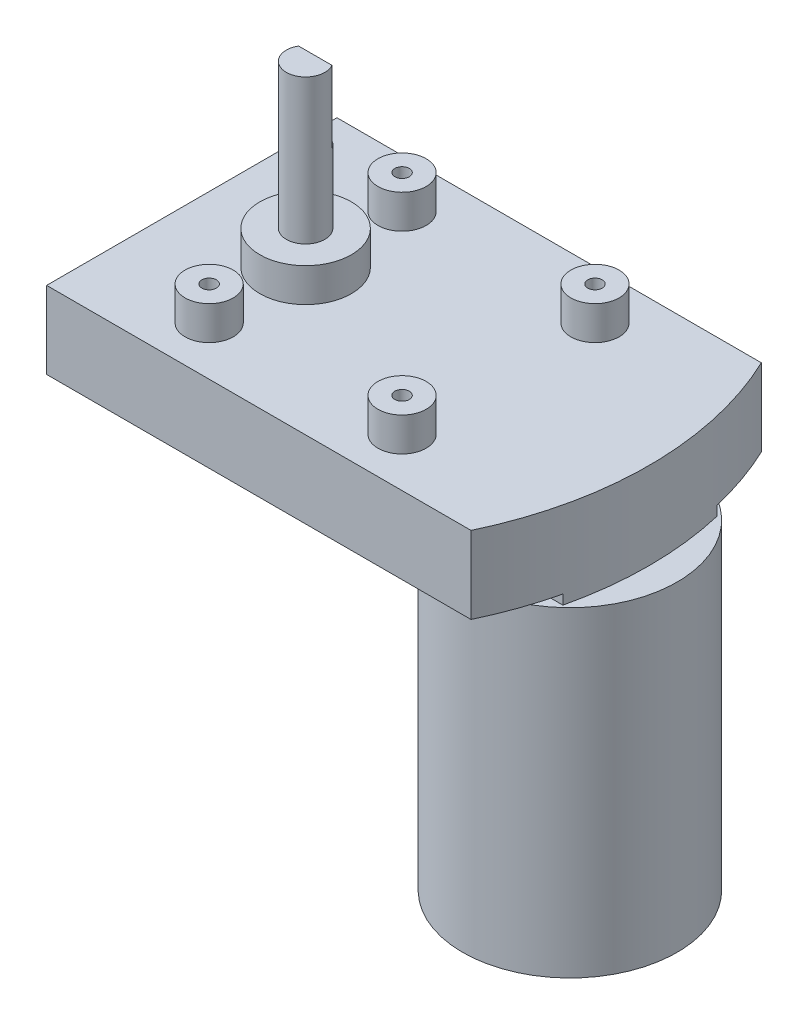
ISO-10303-21;
HEADER;
FILE_DESCRIPTION(('STEP AP214'),'2;1');
FILE_NAME('part.step','',(''),(''),'','','');
FILE_SCHEMA(('AUTOMOTIVE_DESIGN { 1 0 10303 214 1 1 1 1 }'));
ENDSEC;
DATA;
#1=APPLICATION_CONTEXT('core data for automotive mechanical design processes');
#2=APPLICATION_PROTOCOL_DEFINITION('international standard','automotive_design',2000,#1);
#3=PRODUCT_CONTEXT('',#1,'mechanical');
#4=PRODUCT('Part','Part','',(#3));
#5=PRODUCT_RELATED_PRODUCT_CATEGORY('part','',(#4));
#6=PRODUCT_DEFINITION_FORMATION('','',#4);
#7=PRODUCT_DEFINITION_CONTEXT('part definition',#1,'design');
#8=PRODUCT_DEFINITION('design','',#6,#7);
#9=PRODUCT_DEFINITION_SHAPE('','',#8);
#10=(LENGTH_UNIT() NAMED_UNIT(*) SI_UNIT(.MILLI.,.METRE.));
#11=(NAMED_UNIT(*) PLANE_ANGLE_UNIT() SI_UNIT($,.RADIAN.));
#12=(NAMED_UNIT(*) SI_UNIT($,.STERADIAN.) SOLID_ANGLE_UNIT());
#13=UNCERTAINTY_MEASURE_WITH_UNIT(LENGTH_MEASURE(1.E-05),#10,'distance_accuracy_value','');
#14=(GEOMETRIC_REPRESENTATION_CONTEXT(3) GLOBAL_UNCERTAINTY_ASSIGNED_CONTEXT((#13)) GLOBAL_UNIT_ASSIGNED_CONTEXT((#10,
#11,#12)) REPRESENTATION_CONTEXT('',''));
#15=CARTESIAN_POINT('',(0.,0.,0.));
#16=DIRECTION('',(0.,0.,1.));
#17=DIRECTION('',(1.,0.,0.));
#18=AXIS2_PLACEMENT_3D('',#15,#16,#17);
#19=CARTESIAN_POINT('',(-19.1980221209493,-2.,0.));
#20=DIRECTION('',(0.,-1.,0.));
#21=DIRECTION('',(0.,0.,-1.));
#22=AXIS2_PLACEMENT_3D('',#19,#20,#21);
#23=PLANE('',#22);
#24=CARTESIAN_POINT('',(34.4009889395253,-2.,0.));
#25=DIRECTION('',(0.,-1.,0.));
#26=DIRECTION('',(0.,0.,-1.));
#27=AXIS2_PLACEMENT_3D('',#24,#25,#26);
#28=CIRCLE('',#27,22.25);
#29=CARTESIAN_POINT('',(18.9393428434591,-2.,16.));
#30=VERTEX_POINT('',#29);
#31=CARTESIAN_POINT('',(18.,-2.,15.035626418795));
#32=VERTEX_POINT('',#31);
#33=EDGE_CURVE('E55',#30,#32,#28,.T.);
#34=ORIENTED_EDGE('',*,*,#33,.F.);
#35=DIRECTION('',(-1.,0.,0.));
#36=VECTOR('',#35,1.);
#37=CARTESIAN_POINT('',(18.,-2.,16.));
#38=LINE('',#37,#36);
#39=CARTESIAN_POINT('',(18.,-2.,16.));
#40=VERTEX_POINT('',#39);
#41=EDGE_CURVE('E171',#30,#40,#38,.T.);
#42=ORIENTED_EDGE('',*,*,#41,.T.);
#43=DIRECTION('',(0.,0.,-1.));
#44=VECTOR('',#43,1.);
#45=CARTESIAN_POINT('',(18.,-2.,-16.));
#46=LINE('',#45,#44);
#47=EDGE_CURVE('E152',#40,#32,#46,.T.);
#48=ORIENTED_EDGE('',*,*,#47,.T.);
#49=EDGE_LOOP('',(#34,#42,#48));
#50=FACE_BOUND('',#49,.T.);
#51=ADVANCED_FACE('F44',(#50),#23,.T.);
#52=CARTESIAN_POINT('',(0.,0.,0.));
#53=DIRECTION('',(0.,1.,0.));
#54=DIRECTION('',(0.,0.,1.));
#55=AXIS2_PLACEMENT_3D('',#52,#53,#54);
#56=PLANE('',#55);
#57=DIRECTION('',(-1.,0.,0.));
#58=VECTOR('',#57,1.);
#59=CARTESIAN_POINT('',(18.,0.,16.));
#60=LINE('',#59,#58);
#61=CARTESIAN_POINT('',(48.948878028654,0.,16.));
#62=VERTEX_POINT('',#61);
#63=CARTESIAN_POINT('',(18.,0.,16.));
#64=VERTEX_POINT('',#63);
#65=EDGE_CURVE('E179',#62,#64,#60,.T.);
#66=ORIENTED_EDGE('',*,*,#65,.F.);
#67=CARTESIAN_POINT('',(-19.1980221209493,0.,0.));
#68=DIRECTION('',(0.,1.,0.));
#69=DIRECTION('',(0.,0.,1.));
#70=AXIS2_PLACEMENT_3D('',#67,#68,#69);
#71=CIRCLE('',#70,70.);
#72=CARTESIAN_POINT('',(44.,0.,30.1));
#73=VERTEX_POINT('',#72);
#74=EDGE_CURVE('E191',#73,#62,#71,.T.);
#75=ORIENTED_EDGE('',*,*,#74,.F.);
#76=DIRECTION('',(1.,0.,0.));
#77=VECTOR('',#76,1.);
#78=CARTESIAN_POINT('',(-44.,0.,30.1));
#79=LINE('',#78,#77);
#80=CARTESIAN_POINT('',(-44.,0.,30.1));
#81=VERTEX_POINT('',#80);
#82=EDGE_CURVE('E268',#81,#73,#79,.T.);
#83=ORIENTED_EDGE('',*,*,#82,.F.);
#84=DIRECTION('',(0.,0.,-1.));
#85=VECTOR('',#84,1.);
#86=CARTESIAN_POINT('',(-44.,0.,30.1));
#87=LINE('',#86,#85);
#88=CARTESIAN_POINT('',(-44.,0.,-30.1));
#89=VERTEX_POINT('',#88);
#90=EDGE_CURVE('E272',#81,#89,#87,.T.);
#91=ORIENTED_EDGE('',*,*,#90,.T.);
#92=DIRECTION('',(1.,0.,0.));
#93=VECTOR('',#92,1.);
#94=CARTESIAN_POINT('',(-44.,0.,-30.1));
#95=LINE('',#94,#93);
#96=CARTESIAN_POINT('',(44.,0.,-30.1));
#97=VERTEX_POINT('',#96);
#98=EDGE_CURVE('E279',#89,#97,#95,.T.);
#99=ORIENTED_EDGE('',*,*,#98,.T.);
#100=CARTESIAN_POINT('',(48.948878028654,0.,-16.));
#101=VERTEX_POINT('',#100);
#102=EDGE_CURVE('E190',#101,#97,#71,.T.);
#103=ORIENTED_EDGE('',*,*,#102,.F.);
#104=DIRECTION('',(1.,0.,0.));
#105=VECTOR('',#104,1.);
#106=CARTESIAN_POINT('',(18.,0.,-16.));
#107=LINE('',#106,#105);
#108=CARTESIAN_POINT('',(18.,0.,-16.));
#109=VERTEX_POINT('',#108);
#110=EDGE_CURVE('E177',#109,#101,#107,.T.);
#111=ORIENTED_EDGE('',*,*,#110,.F.);
#112=DIRECTION('',(0.,0.,-1.));
#113=VECTOR('',#112,1.);
#114=CARTESIAN_POINT('',(18.,0.,-16.));
#115=LINE('',#114,#113);
#116=EDGE_CURVE('E174',#64,#109,#115,.T.);
#117=ORIENTED_EDGE('',*,*,#116,.F.);
#118=EDGE_LOOP('',(#66,#75,#83,#91,#99,#103,#111,#117));
#119=FACE_BOUND('',#118,.T.);
#120=ADVANCED_FACE('F301',(#119),#56,.F.);
#121=CARTESIAN_POINT('',(-44.,16.,30.1));
#122=DIRECTION('',(0.,0.,-1.));
#123=DIRECTION('',(-1.,0.,0.));
#124=AXIS2_PLACEMENT_3D('',#121,#122,#123);
#125=PLANE('',#124);
#126=ORIENTED_EDGE('',*,*,#82,.T.);
#127=DIRECTION('',(0.,-1.,0.));
#128=VECTOR('',#127,1.);
#129=CARTESIAN_POINT('',(44.,16.,30.1));
#130=LINE('',#129,#128);
#131=CARTESIAN_POINT('',(44.,16.,30.1));
#132=VERTEX_POINT('',#131);
#133=EDGE_CURVE('E48',#132,#73,#130,.T.);
#134=ORIENTED_EDGE('',*,*,#133,.F.);
#135=DIRECTION('',(1.,0.,0.));
#136=VECTOR('',#135,1.);
#137=CARTESIAN_POINT('',(-44.,16.,30.1));
#138=LINE('',#137,#136);
#139=CARTESIAN_POINT('',(-44.,16.,30.1));
#140=VERTEX_POINT('',#139);
#141=EDGE_CURVE('E269',#140,#132,#138,.T.);
#142=ORIENTED_EDGE('',*,*,#141,.F.);
#143=DIRECTION('',(0.,-1.,0.));
#144=VECTOR('',#143,1.);
#145=CARTESIAN_POINT('',(-44.,16.,30.1));
#146=LINE('',#145,#144);
#147=EDGE_CURVE('E277',#140,#81,#146,.T.);
#148=ORIENTED_EDGE('',*,*,#147,.T.);
#149=EDGE_LOOP('',(#126,#134,#142,#148));
#150=FACE_BOUND('',#149,.T.);
#151=ADVANCED_FACE('F46',(#150),#125,.F.);
#152=CARTESIAN_POINT('',(-44.,16.,-30.1));
#153=DIRECTION('',(0.,0.,-1.));
#154=DIRECTION('',(-1.,0.,0.));
#155=AXIS2_PLACEMENT_3D('',#152,#153,#154);
#156=PLANE('',#155);
#157=ORIENTED_EDGE('',*,*,#98,.F.);
#158=DIRECTION('',(0.,-1.,0.));
#159=VECTOR('',#158,1.);
#160=CARTESIAN_POINT('',(-44.,16.,-30.1));
#161=LINE('',#160,#159);
#162=CARTESIAN_POINT('',(-44.,16.,-30.1));
#163=VERTEX_POINT('',#162);
#164=EDGE_CURVE('E285',#163,#89,#161,.T.);
#165=ORIENTED_EDGE('',*,*,#164,.F.);
#166=DIRECTION('',(1.,0.,0.));
#167=VECTOR('',#166,1.);
#168=CARTESIAN_POINT('',(-44.,16.,-30.1));
#169=LINE('',#168,#167);
#170=CARTESIAN_POINT('',(44.,16.,-30.1));
#171=VERTEX_POINT('',#170);
#172=EDGE_CURVE('E271',#163,#171,#169,.T.);
#173=ORIENTED_EDGE('',*,*,#172,.T.);
#174=DIRECTION('',(0.,-1.,0.));
#175=VECTOR('',#174,1.);
#176=CARTESIAN_POINT('',(44.,16.,-30.1));
#177=LINE('',#176,#175);
#178=EDGE_CURVE('E286',#171,#97,#177,.T.);
#179=ORIENTED_EDGE('',*,*,#178,.T.);
#180=EDGE_LOOP('',(#157,#165,#173,#179));
#181=FACE_BOUND('',#180,.T.);
#182=ADVANCED_FACE('F309',(#181),#156,.T.);
#183=CARTESIAN_POINT('',(-44.,16.,30.1));
#184=DIRECTION('',(-1.,0.,0.));
#185=DIRECTION('',(0.,0.,1.));
#186=AXIS2_PLACEMENT_3D('',#183,#184,#185);
#187=PLANE('',#186);
#188=ORIENTED_EDGE('',*,*,#90,.F.);
#189=ORIENTED_EDGE('',*,*,#147,.F.);
#190=DIRECTION('',(0.,0.,-1.));
#191=VECTOR('',#190,1.);
#192=CARTESIAN_POINT('',(-44.,16.,30.1));
#193=LINE('',#192,#191);
#194=EDGE_CURVE('E274',#140,#163,#193,.T.);
#195=ORIENTED_EDGE('',*,*,#194,.T.);
#196=ORIENTED_EDGE('',*,*,#164,.T.);
#197=EDGE_LOOP('',(#188,#189,#195,#196));
#198=FACE_BOUND('',#197,.T.);
#199=ADVANCED_FACE('F315',(#198),#187,.T.);
#200=CARTESIAN_POINT('',(0.,16.,0.));
#201=DIRECTION('',(0.,1.,0.));
#202=DIRECTION('',(0.,0.,1.));
#203=AXIS2_PLACEMENT_3D('',#200,#201,#202);
#204=PLANE('',#203);
#205=CARTESIAN_POINT('',(19.6,16.,20.));
#206=DIRECTION('',(0.,1.,0.));
#207=DIRECTION('',(0.,0.,1.));
#208=AXIS2_PLACEMENT_3D('',#205,#206,#207);
#209=CIRCLE('',#208,5.);
#210=CARTESIAN_POINT('',(19.6,16.,25.));
#211=VERTEX_POINT('',#210);
#212=EDGE_CURVE('E241',#211,#211,#209,.F.);
#213=ORIENTED_EDGE('',*,*,#212,.T.);
#214=EDGE_LOOP('',(#213));
#215=FACE_BOUND('',#214,.T.);
#216=CARTESIAN_POINT('',(19.6,16.,-20.));
#217=DIRECTION('',(0.,1.,0.));
#218=DIRECTION('',(0.,0.,1.));
#219=AXIS2_PLACEMENT_3D('',#216,#217,#218);
#220=CIRCLE('',#219,5.);
#221=CARTESIAN_POINT('',(19.6,16.,-15.));
#222=VERTEX_POINT('',#221);
#223=EDGE_CURVE('E247',#222,#222,#220,.F.);
#224=ORIENTED_EDGE('',*,*,#223,.T.);
#225=EDGE_LOOP('',(#224));
#226=FACE_BOUND('',#225,.T.);
#227=CARTESIAN_POINT('',(-20.4,16.,-20.));
#228=DIRECTION('',(0.,1.,0.));
#229=DIRECTION('',(0.,0.,1.));
#230=AXIS2_PLACEMENT_3D('',#227,#228,#229);
#231=CIRCLE('',#230,5.);
#232=CARTESIAN_POINT('',(-20.4,16.,-15.));
#233=VERTEX_POINT('',#232);
#234=EDGE_CURVE('E253',#233,#233,#231,.F.);
#235=ORIENTED_EDGE('',*,*,#234,.T.);
#236=EDGE_LOOP('',(#235));
#237=FACE_BOUND('',#236,.T.);
#238=CARTESIAN_POINT('',(-20.4,16.,0.));
#239=DIRECTION('',(0.,1.,0.));
#240=DIRECTION('',(0.,0.,1.));
#241=AXIS2_PLACEMENT_3D('',#238,#239,#240);
#242=CIRCLE('',#241,9.5);
#243=CARTESIAN_POINT('',(-20.4,16.,9.50000000000001));
#244=VERTEX_POINT('',#243);
#245=EDGE_CURVE('E259',#244,#244,#242,.F.);
#246=ORIENTED_EDGE('',*,*,#245,.T.);
#247=EDGE_LOOP('',(#246));
#248=FACE_BOUND('',#247,.T.);
#249=CARTESIAN_POINT('',(-20.4,16.,20.));
#250=DIRECTION('',(0.,1.,0.));
#251=DIRECTION('',(0.,0.,1.));
#252=AXIS2_PLACEMENT_3D('',#249,#250,#251);
#253=CIRCLE('',#252,5.);
#254=CARTESIAN_POINT('',(-20.4,16.,25.));
#255=VERTEX_POINT('',#254);
#256=EDGE_CURVE('E265',#255,#255,#253,.F.);
#257=ORIENTED_EDGE('',*,*,#256,.T.);
#258=EDGE_LOOP('',(#257));
#259=FACE_BOUND('',#258,.T.);
#260=ORIENTED_EDGE('',*,*,#141,.T.);
#261=CARTESIAN_POINT('',(-19.1980221209493,16.,0.));
#262=DIRECTION('',(0.,1.,0.));
#263=DIRECTION('',(0.,0.,1.));
#264=AXIS2_PLACEMENT_3D('',#261,#262,#263);
#265=CIRCLE('',#264,70.);
#266=EDGE_CURVE('E194',#132,#171,#265,.T.);
#267=ORIENTED_EDGE('',*,*,#266,.T.);
#268=ORIENTED_EDGE('',*,*,#172,.F.);
#269=ORIENTED_EDGE('',*,*,#194,.F.);
#270=EDGE_LOOP('',(#260,#267,#268,#269));
#271=FACE_BOUND('',#270,.T.);
#272=ADVANCED_FACE('F314',(#215,#226,#237,#248,#259,#271),#204,.T.);
#273=CARTESIAN_POINT('',(-20.4,23.,20.));
#274=DIRECTION('',(0.,-1.,0.));
#275=DIRECTION('',(0.,0.,-1.));
#276=AXIS2_PLACEMENT_3D('',#273,#274,#275);
#277=CYLINDRICAL_SURFACE('',#276,5.);
#278=ORIENTED_EDGE('',*,*,#256,.F.);
#279=EDGE_LOOP('',(#278));
#280=FACE_BOUND('',#279,.T.);
#281=CARTESIAN_POINT('',(-20.4,23.,20.));
#282=DIRECTION('',(0.,1.,0.));
#283=DIRECTION('',(0.,0.,1.));
#284=AXIS2_PLACEMENT_3D('',#281,#282,#283);
#285=CIRCLE('',#284,5.);
#286=CARTESIAN_POINT('',(-20.4,23.,25.));
#287=VERTEX_POINT('',#286);
#288=EDGE_CURVE('E262',#287,#287,#285,.T.);
#289=ORIENTED_EDGE('',*,*,#288,.F.);
#290=EDGE_LOOP('',(#289));
#291=FACE_BOUND('',#290,.T.);
#292=ADVANCED_FACE('F427',(#280,#291),#277,.T.);
#293=CARTESIAN_POINT('',(-20.4,23.,20.));
#294=DIRECTION('',(0.,1.,0.));
#295=DIRECTION('',(0.,0.,1.));
#296=AXIS2_PLACEMENT_3D('',#293,#294,#295);
#297=PLANE('',#296);
#298=CARTESIAN_POINT('',(-20.4,23.,20.));
#299=DIRECTION('',(0.,1.,0.));
#300=DIRECTION('',(0.,0.,1.));
#301=AXIS2_PLACEMENT_3D('',#298,#299,#300);
#302=CIRCLE('',#301,1.5);
#303=CARTESIAN_POINT('',(-20.4,23.,21.5));
#304=VERTEX_POINT('',#303);
#305=EDGE_CURVE('E197',#304,#304,#302,.T.);
#306=ORIENTED_EDGE('',*,*,#305,.F.);
#307=EDGE_LOOP('',(#306));
#308=FACE_BOUND('',#307,.T.);
#309=ORIENTED_EDGE('',*,*,#288,.T.);
#310=EDGE_LOOP('',(#309));
#311=FACE_BOUND('',#310,.T.);
#312=ADVANCED_FACE('F420',(#308,#311),#297,.T.);
#313=CARTESIAN_POINT('',(-20.4,23.,0.));
#314=DIRECTION('',(0.,-1.,0.));
#315=DIRECTION('',(0.,0.,-1.));
#316=AXIS2_PLACEMENT_3D('',#313,#314,#315);
#317=CYLINDRICAL_SURFACE('',#316,9.5);
#318=ORIENTED_EDGE('',*,*,#245,.F.);
#319=EDGE_LOOP('',(#318));
#320=FACE_BOUND('',#319,.T.);
#321=CARTESIAN_POINT('',(-20.4,23.,0.));
#322=DIRECTION('',(0.,1.,0.));
#323=DIRECTION('',(0.,0.,1.));
#324=AXIS2_PLACEMENT_3D('',#321,#322,#323);
#325=CIRCLE('',#324,9.5);
#326=CARTESIAN_POINT('',(-20.4,23.,9.50000000000001));
#327=VERTEX_POINT('',#326);
#328=EDGE_CURVE('E256',#327,#327,#325,.T.);
#329=ORIENTED_EDGE('',*,*,#328,.F.);
#330=EDGE_LOOP('',(#329));
#331=FACE_BOUND('',#330,.T.);
#332=ADVANCED_FACE('F417',(#320,#331),#317,.T.);
#333=CARTESIAN_POINT('',(-20.4,23.,0.));
#334=DIRECTION('',(0.,1.,0.));
#335=DIRECTION('',(0.,0.,1.));
#336=AXIS2_PLACEMENT_3D('',#333,#334,#335);
#337=PLANE('',#336);
#338=CARTESIAN_POINT('',(-20.4,23.,0.));
#339=DIRECTION('',(0.,1.,0.));
#340=DIRECTION('',(0.,0.,1.));
#341=AXIS2_PLACEMENT_3D('',#338,#339,#340);
#342=CIRCLE('',#341,4.);
#343=CARTESIAN_POINT('',(-20.4,23.,4.00000000000001));
#344=VERTEX_POINT('',#343);
#345=EDGE_CURVE('E53',#344,#344,#342,.T.);
#346=ORIENTED_EDGE('',*,*,#345,.F.);
#347=EDGE_LOOP('',(#346));
#348=FACE_BOUND('',#347,.T.);
#349=ORIENTED_EDGE('',*,*,#328,.T.);
#350=EDGE_LOOP('',(#349));
#351=FACE_BOUND('',#350,.T.);
#352=ADVANCED_FACE('F412',(#348,#351),#337,.T.);
#353=CARTESIAN_POINT('',(-20.4,23.,-20.));
#354=DIRECTION('',(0.,-1.,0.));
#355=DIRECTION('',(0.,0.,-1.));
#356=AXIS2_PLACEMENT_3D('',#353,#354,#355);
#357=CYLINDRICAL_SURFACE('',#356,5.);
#358=ORIENTED_EDGE('',*,*,#234,.F.);
#359=EDGE_LOOP('',(#358));
#360=FACE_BOUND('',#359,.T.);
#361=CARTESIAN_POINT('',(-20.4,23.,-20.));
#362=DIRECTION('',(0.,1.,0.));
#363=DIRECTION('',(0.,0.,1.));
#364=AXIS2_PLACEMENT_3D('',#361,#362,#363);
#365=CIRCLE('',#364,5.);
#366=CARTESIAN_POINT('',(-20.4,23.,-15.));
#367=VERTEX_POINT('',#366);
#368=EDGE_CURVE('E250',#367,#367,#365,.T.);
#369=ORIENTED_EDGE('',*,*,#368,.F.);
#370=EDGE_LOOP('',(#369));
#371=FACE_BOUND('',#370,.T.);
#372=ADVANCED_FACE('F409',(#360,#371),#357,.T.);
#373=CARTESIAN_POINT('',(-20.4,23.,-20.));
#374=DIRECTION('',(0.,1.,0.));
#375=DIRECTION('',(0.,0.,1.));
#376=AXIS2_PLACEMENT_3D('',#373,#374,#375);
#377=PLANE('',#376);
#378=CARTESIAN_POINT('',(-20.4,23.,-20.));
#379=DIRECTION('',(0.,1.,0.));
#380=DIRECTION('',(0.,0.,1.));
#381=AXIS2_PLACEMENT_3D('',#378,#379,#380);
#382=CIRCLE('',#381,1.5);
#383=CARTESIAN_POINT('',(-20.4,23.,-18.5));
#384=VERTEX_POINT('',#383);
#385=EDGE_CURVE('E201',#384,#384,#382,.T.);
#386=ORIENTED_EDGE('',*,*,#385,.F.);
#387=EDGE_LOOP('',(#386));
#388=FACE_BOUND('',#387,.T.);
#389=ORIENTED_EDGE('',*,*,#368,.T.);
#390=EDGE_LOOP('',(#389));
#391=FACE_BOUND('',#390,.T.);
#392=ADVANCED_FACE('F404',(#388,#391),#377,.T.);
#393=CARTESIAN_POINT('',(19.6,23.,-20.));
#394=DIRECTION('',(0.,-1.,0.));
#395=DIRECTION('',(0.,0.,-1.));
#396=AXIS2_PLACEMENT_3D('',#393,#394,#395);
#397=CYLINDRICAL_SURFACE('',#396,5.);
#398=ORIENTED_EDGE('',*,*,#223,.F.);
#399=EDGE_LOOP('',(#398));
#400=FACE_BOUND('',#399,.T.);
#401=CARTESIAN_POINT('',(19.6,23.,-20.));
#402=DIRECTION('',(0.,1.,0.));
#403=DIRECTION('',(0.,0.,1.));
#404=AXIS2_PLACEMENT_3D('',#401,#402,#403);
#405=CIRCLE('',#404,5.);
#406=CARTESIAN_POINT('',(19.6,23.,-15.));
#407=VERTEX_POINT('',#406);
#408=EDGE_CURVE('E244',#407,#407,#405,.T.);
#409=ORIENTED_EDGE('',*,*,#408,.F.);
#410=EDGE_LOOP('',(#409));
#411=FACE_BOUND('',#410,.T.);
#412=ADVANCED_FACE('F401',(#400,#411),#397,.T.);
#413=CARTESIAN_POINT('',(19.6,23.,-20.));
#414=DIRECTION('',(0.,1.,0.));
#415=DIRECTION('',(0.,0.,1.));
#416=AXIS2_PLACEMENT_3D('',#413,#414,#415);
#417=PLANE('',#416);
#418=CARTESIAN_POINT('',(19.6,23.,-20.));
#419=DIRECTION('',(0.,1.,0.));
#420=DIRECTION('',(0.,0.,1.));
#421=AXIS2_PLACEMENT_3D('',#418,#419,#420);
#422=CIRCLE('',#421,1.5);
#423=CARTESIAN_POINT('',(19.6,23.,-18.5));
#424=VERTEX_POINT('',#423);
#425=EDGE_CURVE('E202',#424,#424,#422,.T.);
#426=ORIENTED_EDGE('',*,*,#425,.F.);
#427=EDGE_LOOP('',(#426));
#428=FACE_BOUND('',#427,.T.);
#429=ORIENTED_EDGE('',*,*,#408,.T.);
#430=EDGE_LOOP('',(#429));
#431=FACE_BOUND('',#430,.T.);
#432=ADVANCED_FACE('F396',(#428,#431),#417,.T.);
#433=CARTESIAN_POINT('',(19.6,23.,20.));
#434=DIRECTION('',(0.,-1.,0.));
#435=DIRECTION('',(0.,0.,-1.));
#436=AXIS2_PLACEMENT_3D('',#433,#434,#435);
#437=CYLINDRICAL_SURFACE('',#436,5.);
#438=ORIENTED_EDGE('',*,*,#212,.F.);
#439=EDGE_LOOP('',(#438));
#440=FACE_BOUND('',#439,.T.);
#441=CARTESIAN_POINT('',(19.6,23.,20.));
#442=DIRECTION('',(0.,1.,0.));
#443=DIRECTION('',(0.,0.,1.));
#444=AXIS2_PLACEMENT_3D('',#441,#442,#443);
#445=CIRCLE('',#444,5.);
#446=CARTESIAN_POINT('',(19.6,23.,25.));
#447=VERTEX_POINT('',#446);
#448=EDGE_CURVE('E236',#447,#447,#445,.T.);
#449=ORIENTED_EDGE('',*,*,#448,.F.);
#450=EDGE_LOOP('',(#449));
#451=FACE_BOUND('',#450,.T.);
#452=ADVANCED_FACE('F393',(#440,#451),#437,.T.);
#453=CARTESIAN_POINT('',(19.6,23.,20.));
#454=DIRECTION('',(0.,1.,0.));
#455=DIRECTION('',(0.,0.,1.));
#456=AXIS2_PLACEMENT_3D('',#453,#454,#455);
#457=PLANE('',#456);
#458=CARTESIAN_POINT('',(19.6,23.,20.));
#459=DIRECTION('',(0.,1.,0.));
#460=DIRECTION('',(0.,0.,1.));
#461=AXIS2_PLACEMENT_3D('',#458,#459,#460);
#462=CIRCLE('',#461,1.5);
#463=CARTESIAN_POINT('',(19.6,23.,21.5));
#464=VERTEX_POINT('',#463);
#465=EDGE_CURVE('E208',#464,#464,#462,.T.);
#466=ORIENTED_EDGE('',*,*,#465,.F.);
#467=EDGE_LOOP('',(#466));
#468=FACE_BOUND('',#467,.T.);
#469=ORIENTED_EDGE('',*,*,#448,.T.);
#470=EDGE_LOOP('',(#469));
#471=FACE_BOUND('',#470,.T.);
#472=ADVANCED_FACE('F391',(#468,#471),#457,.T.);
#473=CARTESIAN_POINT('',(-20.4,53.,0.));
#474=DIRECTION('',(0.,-1.,0.));
#475=DIRECTION('',(0.,0.,-1.));
#476=AXIS2_PLACEMENT_3D('',#473,#474,#475);
#477=CYLINDRICAL_SURFACE('',#476,4.);
#478=CARTESIAN_POINT('',(-20.4,53.,0.));
#479=DIRECTION('',(0.,1.,0.));
#480=DIRECTION('',(0.,0.,1.));
#481=AXIS2_PLACEMENT_3D('',#478,#479,#480);
#482=CIRCLE('',#481,4.);
#483=CARTESIAN_POINT('',(-23.8641016151378,53.,-2.));
#484=VERTEX_POINT('',#483);
#485=CARTESIAN_POINT('',(-16.9358983848623,53.,-2.));
#486=VERTEX_POINT('',#485);
#487=EDGE_CURVE('E232',#484,#486,#482,.T.);
#488=ORIENTED_EDGE('',*,*,#487,.F.);
#489=DIRECTION('',(0.,1.,0.));
#490=VECTOR('',#489,1.);
#491=CARTESIAN_POINT('',(-23.8641016151378,38.,-2.));
#492=LINE('',#491,#490);
#493=CARTESIAN_POINT('',(-23.8641016151378,38.,-2.));
#494=VERTEX_POINT('',#493);
#495=EDGE_CURVE('E227',#494,#484,#492,.T.);
#496=ORIENTED_EDGE('',*,*,#495,.F.);
#497=CARTESIAN_POINT('',(-20.4,38.,0.));
#498=DIRECTION('',(0.,1.,0.));
#499=DIRECTION('',(0.,0.,1.));
#500=AXIS2_PLACEMENT_3D('',#497,#498,#499);
#501=CIRCLE('',#500,4.);
#502=CARTESIAN_POINT('',(-16.9358983848623,38.,-2.));
#503=VERTEX_POINT('',#502);
#504=EDGE_CURVE('E222',#503,#494,#501,.T.);
#505=ORIENTED_EDGE('',*,*,#504,.F.);
#506=DIRECTION('',(0.,1.,0.));
#507=VECTOR('',#506,1.);
#508=CARTESIAN_POINT('',(-16.9358983848623,38.,-2.));
#509=LINE('',#508,#507);
#510=EDGE_CURVE('E229',#503,#486,#509,.T.);
#511=ORIENTED_EDGE('',*,*,#510,.T.);
#512=EDGE_LOOP('',(#488,#496,#505,#511));
#513=FACE_BOUND('',#512,.T.);
#514=ORIENTED_EDGE('',*,*,#345,.T.);
#515=EDGE_LOOP('',(#514));
#516=FACE_BOUND('',#515,.T.);
#517=ADVANCED_FACE('F387',(#513,#516),#477,.T.);
#518=CARTESIAN_POINT('',(-20.4,53.,0.));
#519=DIRECTION('',(0.,1.,0.));
#520=DIRECTION('',(0.,0.,1.));
#521=AXIS2_PLACEMENT_3D('',#518,#519,#520);
#522=PLANE('',#521);
#523=DIRECTION('',(1.,0.,0.));
#524=VECTOR('',#523,1.);
#525=CARTESIAN_POINT('',(-23.8641016151378,53.,-2.));
#526=LINE('',#525,#524);
#527=EDGE_CURVE('E219',#484,#486,#526,.T.);
#528=ORIENTED_EDGE('',*,*,#527,.F.);
#529=ORIENTED_EDGE('',*,*,#487,.T.);
#530=EDGE_LOOP('',(#528,#529));
#531=FACE_BOUND('',#530,.T.);
#532=ADVANCED_FACE('F383',(#531),#522,.T.);
#533=CARTESIAN_POINT('',(-23.8641016151378,38.,-2.));
#534=DIRECTION('',(0.,0.,1.));
#535=DIRECTION('',(1.,0.,0.));
#536=AXIS2_PLACEMENT_3D('',#533,#534,#535);
#537=PLANE('',#536);
#538=ORIENTED_EDGE('',*,*,#527,.T.);
#539=ORIENTED_EDGE('',*,*,#510,.F.);
#540=DIRECTION('',(1.,0.,0.));
#541=VECTOR('',#540,1.);
#542=CARTESIAN_POINT('',(-23.8641016151378,38.,-2.));
#543=LINE('',#542,#541);
#544=EDGE_CURVE('E224',#494,#503,#543,.T.);
#545=ORIENTED_EDGE('',*,*,#544,.F.);
#546=ORIENTED_EDGE('',*,*,#495,.T.);
#547=EDGE_LOOP('',(#538,#539,#545,#546));
#548=FACE_BOUND('',#547,.T.);
#549=ADVANCED_FACE('F379',(#548),#537,.F.);
#550=CARTESIAN_POINT('',(-20.4,38.,0.));
#551=DIRECTION('',(0.,1.,0.));
#552=DIRECTION('',(0.,0.,1.));
#553=AXIS2_PLACEMENT_3D('',#550,#551,#552);
#554=PLANE('',#553);
#555=ORIENTED_EDGE('',*,*,#504,.T.);
#556=ORIENTED_EDGE('',*,*,#544,.T.);
#557=EDGE_LOOP('',(#555,#556));
#558=FACE_BOUND('',#557,.T.);
#559=ADVANCED_FACE('F361',(#558),#554,.T.);
#560=CARTESIAN_POINT('',(19.6,13.,20.));
#561=DIRECTION('',(0.,1.,0.));
#562=DIRECTION('',(0.,0.,1.));
#563=AXIS2_PLACEMENT_3D('',#560,#561,#562);
#564=CYLINDRICAL_SURFACE('',#563,1.5);
#565=CARTESIAN_POINT('',(19.6,13.,20.));
#566=DIRECTION('',(0.,1.,0.));
#567=DIRECTION('',(0.,0.,1.));
#568=AXIS2_PLACEMENT_3D('',#565,#566,#567);
#569=CIRCLE('',#568,1.5);
#570=CARTESIAN_POINT('',(19.6,13.,21.5));
#571=VERTEX_POINT('',#570);
#572=EDGE_CURVE('E205',#571,#571,#569,.T.);
#573=ORIENTED_EDGE('',*,*,#572,.F.);
#574=EDGE_LOOP('',(#573));
#575=FACE_BOUND('',#574,.T.);
#576=ORIENTED_EDGE('',*,*,#465,.T.);
#577=EDGE_LOOP('',(#576));
#578=FACE_BOUND('',#577,.T.);
#579=ADVANCED_FACE('F357',(#575,#578),#564,.F.);
#580=CARTESIAN_POINT('',(19.6,13.,20.));
#581=DIRECTION('',(0.,1.,0.));
#582=DIRECTION('',(0.,0.,1.));
#583=AXIS2_PLACEMENT_3D('',#580,#581,#582);
#584=PLANE('',#583);
#585=ORIENTED_EDGE('',*,*,#572,.T.);
#586=EDGE_LOOP('',(#585));
#587=FACE_BOUND('',#586,.T.);
#588=ADVANCED_FACE('F353',(#587),#584,.T.);
#589=CARTESIAN_POINT('',(19.6,13.,-20.));
#590=DIRECTION('',(0.,1.,0.));
#591=DIRECTION('',(0.,0.,1.));
#592=AXIS2_PLACEMENT_3D('',#589,#590,#591);
#593=CYLINDRICAL_SURFACE('',#592,1.5);
#594=CARTESIAN_POINT('',(19.6,13.,-20.));
#595=DIRECTION('',(0.,1.,0.));
#596=DIRECTION('',(0.,0.,1.));
#597=AXIS2_PLACEMENT_3D('',#594,#595,#596);
#598=CIRCLE('',#597,1.5);
#599=CARTESIAN_POINT('',(19.6,13.,-18.5));
#600=VERTEX_POINT('',#599);
#601=EDGE_CURVE('E198',#600,#600,#598,.T.);
#602=ORIENTED_EDGE('',*,*,#601,.F.);
#603=EDGE_LOOP('',(#602));
#604=FACE_BOUND('',#603,.T.);
#605=ORIENTED_EDGE('',*,*,#425,.T.);
#606=EDGE_LOOP('',(#605));
#607=FACE_BOUND('',#606,.T.);
#608=ADVANCED_FACE('F349',(#604,#607),#593,.F.);
#609=CARTESIAN_POINT('',(19.6,13.,-20.));
#610=DIRECTION('',(0.,1.,0.));
#611=DIRECTION('',(0.,0.,1.));
#612=AXIS2_PLACEMENT_3D('',#609,#610,#611);
#613=PLANE('',#612);
#614=ORIENTED_EDGE('',*,*,#601,.T.);
#615=EDGE_LOOP('',(#614));
#616=FACE_BOUND('',#615,.T.);
#617=ADVANCED_FACE('F345',(#616),#613,.T.);
#618=CARTESIAN_POINT('',(-20.4,13.,-20.));
#619=DIRECTION('',(0.,1.,0.));
#620=DIRECTION('',(0.,0.,1.));
#621=AXIS2_PLACEMENT_3D('',#618,#619,#620);
#622=CYLINDRICAL_SURFACE('',#621,1.5);
#623=CARTESIAN_POINT('',(-20.4,13.,-20.));
#624=DIRECTION('',(0.,1.,0.));
#625=DIRECTION('',(0.,0.,1.));
#626=AXIS2_PLACEMENT_3D('',#623,#624,#625);
#627=CIRCLE('',#626,1.5);
#628=CARTESIAN_POINT('',(-20.4,13.,-18.5));
#629=VERTEX_POINT('',#628);
#630=EDGE_CURVE('E216',#629,#629,#627,.T.);
#631=ORIENTED_EDGE('',*,*,#630,.F.);
#632=EDGE_LOOP('',(#631));
#633=FACE_BOUND('',#632,.T.);
#634=ORIENTED_EDGE('',*,*,#385,.T.);
#635=EDGE_LOOP('',(#634));
#636=FACE_BOUND('',#635,.T.);
#637=ADVANCED_FACE('F348',(#633,#636),#622,.F.);
#638=CARTESIAN_POINT('',(-20.4,13.,-20.));
#639=DIRECTION('',(0.,1.,0.));
#640=DIRECTION('',(0.,0.,1.));
#641=AXIS2_PLACEMENT_3D('',#638,#639,#640);
#642=PLANE('',#641);
#643=ORIENTED_EDGE('',*,*,#630,.T.);
#644=EDGE_LOOP('',(#643));
#645=FACE_BOUND('',#644,.T.);
#646=ADVANCED_FACE('F369',(#645),#642,.T.);
#647=CARTESIAN_POINT('',(-20.4,13.,20.));
#648=DIRECTION('',(0.,1.,0.));
#649=DIRECTION('',(0.,0.,1.));
#650=AXIS2_PLACEMENT_3D('',#647,#648,#649);
#651=CYLINDRICAL_SURFACE('',#650,1.5);
#652=CARTESIAN_POINT('',(-20.4,13.,20.));
#653=DIRECTION('',(0.,1.,0.));
#654=DIRECTION('',(0.,0.,1.));
#655=AXIS2_PLACEMENT_3D('',#652,#653,#654);
#656=CIRCLE('',#655,1.5);
#657=CARTESIAN_POINT('',(-20.4,13.,21.5));
#658=VERTEX_POINT('',#657);
#659=EDGE_CURVE('E211',#658,#658,#656,.T.);
#660=ORIENTED_EDGE('',*,*,#659,.F.);
#661=EDGE_LOOP('',(#660));
#662=FACE_BOUND('',#661,.T.);
#663=ORIENTED_EDGE('',*,*,#305,.T.);
#664=EDGE_LOOP('',(#663));
#665=FACE_BOUND('',#664,.T.);
#666=ADVANCED_FACE('F365',(#662,#665),#651,.F.);
#667=CARTESIAN_POINT('',(-20.4,13.,20.));
#668=DIRECTION('',(0.,1.,0.));
#669=DIRECTION('',(0.,0.,1.));
#670=AXIS2_PLACEMENT_3D('',#667,#668,#669);
#671=PLANE('',#670);
#672=ORIENTED_EDGE('',*,*,#659,.T.);
#673=EDGE_LOOP('',(#672));
#674=FACE_BOUND('',#673,.T.);
#675=ADVANCED_FACE('F344',(#674),#671,.T.);
#676=CARTESIAN_POINT('',(-19.1980221209493,76.5830578880523,0.));
#677=DIRECTION('',(0.,-1.,0.));
#678=DIRECTION('',(0.,0.,-1.));
#679=AXIS2_PLACEMENT_3D('',#676,#677,#678);
#680=CYLINDRICAL_SURFACE('',#679,70.);
#681=ORIENTED_EDGE('',*,*,#266,.F.);
#682=ORIENTED_EDGE('',*,*,#133,.T.);
#683=ORIENTED_EDGE('',*,*,#74,.T.);
#684=DIRECTION('',(0.,1.,0.));
#685=VECTOR('',#684,1.);
#686=CARTESIAN_POINT('',(48.948878028654,-2.,16.));
#687=LINE('',#686,#685);
#688=CARTESIAN_POINT('',(48.948878028654,-2.,16.));
#689=VERTEX_POINT('',#688);
#690=EDGE_CURVE('E184',#689,#62,#687,.T.);
#691=ORIENTED_EDGE('',*,*,#690,.F.);
#692=CARTESIAN_POINT('',(-19.1980221209493,-2.,0.));
#693=DIRECTION('',(0.,-1.,0.));
#694=DIRECTION('',(0.,0.,-1.));
#695=AXIS2_PLACEMENT_3D('',#692,#693,#694);
#696=CIRCLE('',#695,70.);
#697=CARTESIAN_POINT('',(48.948878028654,-2.,-16.));
#698=VERTEX_POINT('',#697);
#699=EDGE_CURVE('E140',#698,#689,#696,.T.);
#700=ORIENTED_EDGE('',*,*,#699,.F.);
#701=DIRECTION('',(0.,1.,0.));
#702=VECTOR('',#701,1.);
#703=CARTESIAN_POINT('',(48.948878028654,-2.,-16.));
#704=LINE('',#703,#702);
#705=EDGE_CURVE('E148',#698,#101,#704,.T.);
#706=ORIENTED_EDGE('',*,*,#705,.T.);
#707=ORIENTED_EDGE('',*,*,#102,.T.);
#708=ORIENTED_EDGE('',*,*,#178,.F.);
#709=EDGE_LOOP('',(#681,#682,#683,#691,#700,#706,#707,#708));
#710=FACE_BOUND('',#709,.T.);
#711=ADVANCED_FACE('F296',(#710),#680,.T.);
#712=CARTESIAN_POINT('',(18.,-2.,-16.));
#713=DIRECTION('',(1.,0.,0.));
#714=DIRECTION('',(0.,0.,-1.));
#715=AXIS2_PLACEMENT_3D('',#712,#713,#714);
#716=PLANE('',#715);
#717=ORIENTED_EDGE('',*,*,#116,.T.);
#718=DIRECTION('',(0.,1.,0.));
#719=VECTOR('',#718,1.);
#720=CARTESIAN_POINT('',(18.,-2.,-16.));
#721=LINE('',#720,#719);
#722=CARTESIAN_POINT('',(18.,-2.,-16.));
#723=VERTEX_POINT('',#722);
#724=EDGE_CURVE('E188',#723,#109,#721,.T.);
#725=ORIENTED_EDGE('',*,*,#724,.F.);
#726=CARTESIAN_POINT('',(18.,-2.,-15.035626418795));
#727=VERTEX_POINT('',#726);
#728=EDGE_CURVE('E136',#727,#723,#46,.T.);
#729=ORIENTED_EDGE('',*,*,#728,.F.);
#730=EDGE_CURVE('E168',#32,#727,#46,.T.);
#731=ORIENTED_EDGE('',*,*,#730,.F.);
#732=ORIENTED_EDGE('',*,*,#47,.F.);
#733=DIRECTION('',(0.,1.,0.));
#734=VECTOR('',#733,1.);
#735=CARTESIAN_POINT('',(18.,-2.,16.));
#736=LINE('',#735,#734);
#737=EDGE_CURVE('E173',#40,#64,#736,.T.);
#738=ORIENTED_EDGE('',*,*,#737,.T.);
#739=EDGE_LOOP('',(#717,#725,#729,#731,#732,#738));
#740=FACE_BOUND('',#739,.T.);
#741=ADVANCED_FACE('F308',(#740),#716,.F.);
#742=CARTESIAN_POINT('',(18.,-2.,-16.));
#743=DIRECTION('',(0.,0.,1.));
#744=DIRECTION('',(1.,0.,0.));
#745=AXIS2_PLACEMENT_3D('',#742,#743,#744);
#746=PLANE('',#745);
#747=ORIENTED_EDGE('',*,*,#110,.T.);
#748=ORIENTED_EDGE('',*,*,#705,.F.);
#749=DIRECTION('',(1.,0.,0.));
#750=VECTOR('',#749,1.);
#751=CARTESIAN_POINT('',(18.,-2.,-16.));
#752=LINE('',#751,#750);
#753=CARTESIAN_POINT('',(18.9393428434591,-2.,-16.));
#754=VERTEX_POINT('',#753);
#755=EDGE_CURVE('E141',#754,#698,#752,.T.);
#756=ORIENTED_EDGE('',*,*,#755,.F.);
#757=EDGE_CURVE('E133',#723,#754,#752,.T.);
#758=ORIENTED_EDGE('',*,*,#757,.F.);
#759=ORIENTED_EDGE('',*,*,#724,.T.);
#760=EDGE_LOOP('',(#747,#748,#756,#758,#759));
#761=FACE_BOUND('',#760,.T.);
#762=ADVANCED_FACE('F146',(#761),#746,.F.);
#763=CARTESIAN_POINT('',(18.,-2.,16.));
#764=DIRECTION('',(0.,0.,-1.));
#765=DIRECTION('',(-1.,0.,0.));
#766=AXIS2_PLACEMENT_3D('',#763,#764,#765);
#767=PLANE('',#766);
#768=ORIENTED_EDGE('',*,*,#65,.T.);
#769=ORIENTED_EDGE('',*,*,#737,.F.);
#770=ORIENTED_EDGE('',*,*,#41,.F.);
#771=EDGE_CURVE('E158',#689,#30,#38,.T.);
#772=ORIENTED_EDGE('',*,*,#771,.F.);
#773=ORIENTED_EDGE('',*,*,#690,.T.);
#774=EDGE_LOOP('',(#768,#769,#770,#772,#773));
#775=FACE_BOUND('',#774,.T.);
#776=ADVANCED_FACE('F305',(#775),#767,.F.);
#777=EDGE_CURVE('E11',#727,#754,#28,.T.);
#778=ORIENTED_EDGE('',*,*,#777,.F.);
#779=ORIENTED_EDGE('',*,*,#728,.T.);
#780=ORIENTED_EDGE('',*,*,#757,.T.);
#781=EDGE_LOOP('',(#778,#779,#780));
#782=FACE_BOUND('',#781,.T.);
#783=ADVANCED_FACE('F135',(#782),#23,.T.);
#784=CARTESIAN_POINT('',(34.4009889395253,-2.,0.));
#785=DIRECTION('',(0.,-1.,0.));
#786=DIRECTION('',(0.,0.,-1.));
#787=AXIS2_PLACEMENT_3D('',#784,#785,#786);
#788=PLANE('',#787);
#789=EDGE_CURVE('E56',#32,#727,#28,.T.);
#790=ORIENTED_EDGE('',*,*,#789,.F.);
#791=ORIENTED_EDGE('',*,*,#730,.T.);
#792=EDGE_LOOP('',(#790,#791));
#793=FACE_BOUND('',#792,.T.);
#794=ADVANCED_FACE('F329',(#793),#788,.F.);
#795=EDGE_CURVE('E155',#754,#30,#28,.T.);
#796=ORIENTED_EDGE('',*,*,#795,.F.);
#797=ORIENTED_EDGE('',*,*,#755,.T.);
#798=ORIENTED_EDGE('',*,*,#699,.T.);
#799=ORIENTED_EDGE('',*,*,#771,.T.);
#800=EDGE_LOOP('',(#796,#797,#798,#799));
#801=FACE_BOUND('',#800,.T.);
#802=ADVANCED_FACE('F156',(#801),#788,.F.);
#803=CARTESIAN_POINT('',(34.4009889395253,-68.5,0.));
#804=DIRECTION('',(0.,1.,0.));
#805=DIRECTION('',(0.,0.,1.));
#806=AXIS2_PLACEMENT_3D('',#803,#804,#805);
#807=CYLINDRICAL_SURFACE('',#806,22.25);
#808=CARTESIAN_POINT('',(34.4009889395253,-68.5,0.));
#809=DIRECTION('',(0.,-1.,0.));
#810=DIRECTION('',(0.,0.,-1.));
#811=AXIS2_PLACEMENT_3D('',#808,#809,#810);
#812=CIRCLE('',#811,22.25);
#813=CARTESIAN_POINT('',(34.4009889395253,-68.5,-22.25));
#814=VERTEX_POINT('',#813);
#815=EDGE_CURVE('E165',#814,#814,#812,.T.);
#816=ORIENTED_EDGE('',*,*,#815,.F.);
#817=EDGE_LOOP('',(#816));
#818=FACE_BOUND('',#817,.T.);
#819=ORIENTED_EDGE('',*,*,#33,.T.);
#820=ORIENTED_EDGE('',*,*,#789,.T.);
#821=ORIENTED_EDGE('',*,*,#777,.T.);
#822=ORIENTED_EDGE('',*,*,#795,.T.);
#823=EDGE_LOOP('',(#819,#820,#821,#822));
#824=FACE_BOUND('',#823,.T.);
#825=ADVANCED_FACE('F161',(#818,#824),#807,.T.);
#826=CARTESIAN_POINT('',(34.4009889395253,-68.5,0.));
#827=DIRECTION('',(0.,-1.,0.));
#828=DIRECTION('',(0.,0.,-1.));
#829=AXIS2_PLACEMENT_3D('',#826,#827,#828);
#830=PLANE('',#829);
#831=ORIENTED_EDGE('',*,*,#815,.T.);
#832=EDGE_LOOP('',(#831));
#833=FACE_BOUND('',#832,.T.);
#834=ADVANCED_FACE('F574',(#833),#830,.T.);
#835=CLOSED_SHELL('',(#51,#120,#151,#182,#199,#272,#292,#312,#332,#352,#372,#392,#412,#432,#452,
#472,#517,#532,#549,#559,#579,#588,#608,#617,#637,#646,#666,#675,#711,#741,#762,#776,#783,#794,
#802,#825,#834));
#836=MANIFOLD_SOLID_BREP('B2',#835);
#837=ADVANCED_BREP_SHAPE_REPRESENTATION('',(#18,#836),#14);
#838=SHAPE_DEFINITION_REPRESENTATION(#9,#837);
ENDSEC;
END-ISO-10303-21;
